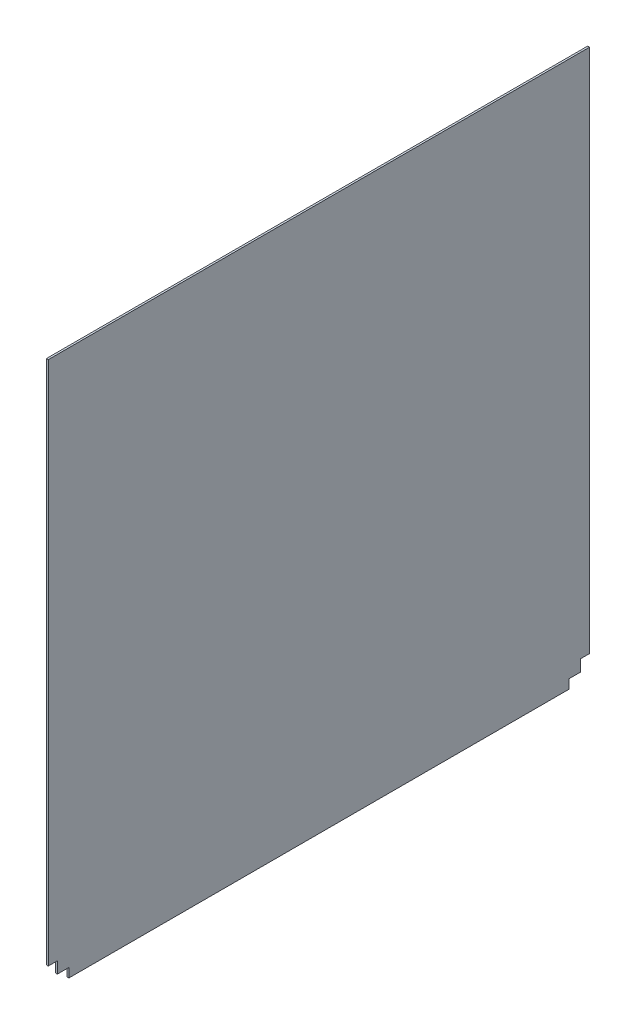
ISO-10303-21;
HEADER;
FILE_DESCRIPTION(('STEP AP214'),'2;1');
FILE_NAME('part.step','',(''),(''),'','','');
FILE_SCHEMA(('AUTOMOTIVE_DESIGN { 1 0 10303 214 1 1 1 1 }'));
ENDSEC;
DATA;
#1=APPLICATION_CONTEXT('core data for automotive mechanical design processes');
#2=APPLICATION_PROTOCOL_DEFINITION('international standard','automotive_design',2000,#1);
#3=PRODUCT_CONTEXT('',#1,'mechanical');
#4=PRODUCT('Part','Part','',(#3));
#5=PRODUCT_RELATED_PRODUCT_CATEGORY('part','',(#4));
#6=PRODUCT_DEFINITION_FORMATION('','',#4);
#7=PRODUCT_DEFINITION_CONTEXT('part definition',#1,'design');
#8=PRODUCT_DEFINITION('design','',#6,#7);
#9=PRODUCT_DEFINITION_SHAPE('','',#8);
#10=(LENGTH_UNIT() NAMED_UNIT(*) SI_UNIT(.MILLI.,.METRE.));
#11=(NAMED_UNIT(*) PLANE_ANGLE_UNIT() SI_UNIT($,.RADIAN.));
#12=(NAMED_UNIT(*) SI_UNIT($,.STERADIAN.) SOLID_ANGLE_UNIT());
#13=UNCERTAINTY_MEASURE_WITH_UNIT(LENGTH_MEASURE(1.E-05),#10,'distance_accuracy_value','');
#14=(GEOMETRIC_REPRESENTATION_CONTEXT(3) GLOBAL_UNCERTAINTY_ASSIGNED_CONTEXT((#13)) GLOBAL_UNIT_ASSIGNED_CONTEXT((#10,
#11,#12)) REPRESENTATION_CONTEXT('',''));
#15=CARTESIAN_POINT('',(0.,0.,0.));
#16=DIRECTION('',(0.,0.,1.));
#17=DIRECTION('',(1.,0.,0.));
#18=AXIS2_PLACEMENT_3D('',#15,#16,#17);
#19=CARTESIAN_POINT('',(3.175,15.24,0.));
#20=DIRECTION('',(0.,1.,0.));
#21=DIRECTION('',(0.,0.,1.));
#22=AXIS2_PLACEMENT_3D('',#19,#20,#21);
#23=PLANE('',#22);
#24=DIRECTION('',(0.,0.,-1.));
#25=VECTOR('',#24,1.);
#26=CARTESIAN_POINT('',(0.,15.24,0.));
#27=LINE('',#26,#25);
#28=CARTESIAN_POINT('',(0.,15.24,-15.24));
#29=VERTEX_POINT('',#28);
#30=CARTESIAN_POINT('',(0.,15.24,-34.544));
#31=VERTEX_POINT('',#30);
#32=EDGE_CURVE('E174',#29,#31,#27,.T.);
#33=ORIENTED_EDGE('',*,*,#32,.T.);
#34=DIRECTION('',(-1.,0.,0.));
#35=VECTOR('',#34,1.);
#36=CARTESIAN_POINT('',(3.175,15.24,-34.544));
#37=LINE('',#36,#35);
#38=CARTESIAN_POINT('',(3.175,15.24,-34.544));
#39=VERTEX_POINT('',#38);
#40=EDGE_CURVE('E11',#39,#31,#37,.T.);
#41=ORIENTED_EDGE('',*,*,#40,.F.);
#42=DIRECTION('',(0.,0.,-1.));
#43=VECTOR('',#42,1.);
#44=CARTESIAN_POINT('',(3.175,15.24,0.));
#45=LINE('',#44,#43);
#46=CARTESIAN_POINT('',(3.175,15.24,-15.24));
#47=VERTEX_POINT('',#46);
#48=EDGE_CURVE('E215',#47,#39,#45,.T.);
#49=ORIENTED_EDGE('',*,*,#48,.F.);
#50=DIRECTION('',(-1.,0.,0.));
#51=VECTOR('',#50,1.);
#52=CARTESIAN_POINT('',(3.175,15.24,-15.24));
#53=LINE('',#52,#51);
#54=EDGE_CURVE('E173',#47,#29,#53,.T.);
#55=ORIENTED_EDGE('',*,*,#54,.T.);
#56=EDGE_LOOP('',(#33,#41,#49,#55));
#57=FACE_BOUND('',#56,.T.);
#58=ADVANCED_FACE('F47',(#57),#23,.F.);
#59=CARTESIAN_POINT('',(3.175,0.,-34.544));
#60=DIRECTION('',(0.,0.,-1.));
#61=DIRECTION('',(0.,1.,0.));
#62=AXIS2_PLACEMENT_3D('',#59,#60,#61);
#63=PLANE('',#62);
#64=DIRECTION('',(0.,-1.,0.));
#65=VECTOR('',#64,1.);
#66=CARTESIAN_POINT('',(0.,0.,-34.544));
#67=LINE('',#66,#65);
#68=CARTESIAN_POINT('',(0.,0.,-34.544));
#69=VERTEX_POINT('',#68);
#70=EDGE_CURVE('E178',#31,#69,#67,.T.);
#71=ORIENTED_EDGE('',*,*,#70,.T.);
#72=DIRECTION('',(-1.,0.,0.));
#73=VECTOR('',#72,1.);
#74=CARTESIAN_POINT('',(3.175,0.,-34.544));
#75=LINE('',#74,#73);
#76=CARTESIAN_POINT('',(3.175,0.,-34.544));
#77=VERTEX_POINT('',#76);
#78=EDGE_CURVE('E56',#77,#69,#75,.T.);
#79=ORIENTED_EDGE('',*,*,#78,.F.);
#80=DIRECTION('',(0.,-1.,0.));
#81=VECTOR('',#80,1.);
#82=CARTESIAN_POINT('',(3.175,0.,-34.544));
#83=LINE('',#82,#81);
#84=EDGE_CURVE('E118',#39,#77,#83,.T.);
#85=ORIENTED_EDGE('',*,*,#84,.F.);
#86=ORIENTED_EDGE('',*,*,#40,.T.);
#87=EDGE_LOOP('',(#71,#79,#85,#86));
#88=FACE_BOUND('',#87,.T.);
#89=ADVANCED_FACE('F300',(#88),#63,.F.);
#90=CARTESIAN_POINT('',(3.175,0.,0.));
#91=DIRECTION('',(0.,1.,0.));
#92=DIRECTION('',(0.,0.,1.));
#93=AXIS2_PLACEMENT_3D('',#90,#91,#92);
#94=PLANE('',#93);
#95=DIRECTION('',(0.,0.,-1.));
#96=VECTOR('',#95,1.);
#97=CARTESIAN_POINT('',(0.,0.,0.));
#98=LINE('',#97,#96);
#99=CARTESIAN_POINT('',(0.,0.,-872.45698));
#100=VERTEX_POINT('',#99);
#101=EDGE_CURVE('E181',#69,#100,#98,.T.);
#102=ORIENTED_EDGE('',*,*,#101,.T.);
#103=DIRECTION('',(-1.,0.,0.));
#104=VECTOR('',#103,1.);
#105=CARTESIAN_POINT('',(3.175,0.,-872.45698));
#106=LINE('',#105,#104);
#107=CARTESIAN_POINT('',(3.175,0.,-872.45698));
#108=VERTEX_POINT('',#107);
#109=EDGE_CURVE('E237',#108,#100,#106,.T.);
#110=ORIENTED_EDGE('',*,*,#109,.F.);
#111=DIRECTION('',(0.,0.,-1.));
#112=VECTOR('',#111,1.);
#113=CARTESIAN_POINT('',(3.175,0.,0.));
#114=LINE('',#113,#112);
#115=EDGE_CURVE('E246',#77,#108,#114,.T.);
#116=ORIENTED_EDGE('',*,*,#115,.F.);
#117=ORIENTED_EDGE('',*,*,#78,.T.);
#118=EDGE_LOOP('',(#102,#110,#116,#117));
#119=FACE_BOUND('',#118,.T.);
#120=ADVANCED_FACE('F244',(#119),#94,.F.);
#121=CARTESIAN_POINT('',(3.175,0.,-872.45698));
#122=DIRECTION('',(0.,0.,-1.));
#123=DIRECTION('',(-1.,0.,0.));
#124=AXIS2_PLACEMENT_3D('',#121,#122,#123);
#125=PLANE('',#124);
#126=DIRECTION('',(0.,-1.,0.));
#127=VECTOR('',#126,1.);
#128=CARTESIAN_POINT('',(0.,0.,-872.45698));
#129=LINE('',#128,#127);
#130=CARTESIAN_POINT('',(0.,15.24,-872.45698));
#131=VERTEX_POINT('',#130);
#132=EDGE_CURVE('E185',#131,#100,#129,.T.);
#133=ORIENTED_EDGE('',*,*,#132,.F.);
#134=DIRECTION('',(-1.,0.,0.));
#135=VECTOR('',#134,1.);
#136=CARTESIAN_POINT('',(3.175,15.24,-872.45698));
#137=LINE('',#136,#135);
#138=CARTESIAN_POINT('',(3.175,15.24,-872.45698));
#139=VERTEX_POINT('',#138);
#140=EDGE_CURVE('E234',#139,#131,#137,.T.);
#141=ORIENTED_EDGE('',*,*,#140,.F.);
#142=DIRECTION('',(0.,-1.,0.));
#143=VECTOR('',#142,1.);
#144=CARTESIAN_POINT('',(3.175,0.,-872.45698));
#145=LINE('',#144,#143);
#146=EDGE_CURVE('E256',#139,#108,#145,.T.);
#147=ORIENTED_EDGE('',*,*,#146,.T.);
#148=ORIENTED_EDGE('',*,*,#109,.T.);
#149=EDGE_LOOP('',(#133,#141,#147,#148));
#150=FACE_BOUND('',#149,.T.);
#151=ADVANCED_FACE('F253',(#150),#125,.T.);
#152=CARTESIAN_POINT('',(3.175,15.24,0.));
#153=DIRECTION('',(0.,-1.,0.));
#154=DIRECTION('',(0.,0.,-1.));
#155=AXIS2_PLACEMENT_3D('',#152,#153,#154);
#156=PLANE('',#155);
#157=DIRECTION('',(0.,0.,1.));
#158=VECTOR('',#157,1.);
#159=CARTESIAN_POINT('',(0.,15.24,0.));
#160=LINE('',#159,#158);
#161=CARTESIAN_POINT('',(0.,15.24,-891.76098));
#162=VERTEX_POINT('',#161);
#163=EDGE_CURVE('E189',#162,#131,#160,.T.);
#164=ORIENTED_EDGE('',*,*,#163,.F.);
#165=DIRECTION('',(-1.,0.,0.));
#166=VECTOR('',#165,1.);
#167=CARTESIAN_POINT('',(3.175,15.24,-891.76098));
#168=LINE('',#167,#166);
#169=CARTESIAN_POINT('',(3.175,15.24,-891.76098));
#170=VERTEX_POINT('',#169);
#171=EDGE_CURVE('E231',#170,#162,#168,.T.);
#172=ORIENTED_EDGE('',*,*,#171,.F.);
#173=DIRECTION('',(0.,0.,1.));
#174=VECTOR('',#173,1.);
#175=CARTESIAN_POINT('',(3.175,15.24,0.));
#176=LINE('',#175,#174);
#177=EDGE_CURVE('E260',#170,#139,#176,.T.);
#178=ORIENTED_EDGE('',*,*,#177,.T.);
#179=ORIENTED_EDGE('',*,*,#140,.T.);
#180=EDGE_LOOP('',(#164,#172,#178,#179));
#181=FACE_BOUND('',#180,.T.);
#182=ADVANCED_FACE('F311',(#181),#156,.T.);
#183=CARTESIAN_POINT('',(3.175,0.,-891.76098));
#184=DIRECTION('',(0.,0.,-1.));
#185=DIRECTION('',(-1.,0.,0.));
#186=AXIS2_PLACEMENT_3D('',#183,#184,#185);
#187=PLANE('',#186);
#188=DIRECTION('',(0.,-1.,0.));
#189=VECTOR('',#188,1.);
#190=CARTESIAN_POINT('',(0.,0.,-891.76098));
#191=LINE('',#190,#189);
#192=CARTESIAN_POINT('',(0.,34.544,-891.76098));
#193=VERTEX_POINT('',#192);
#194=EDGE_CURVE('E193',#193,#162,#191,.T.);
#195=ORIENTED_EDGE('',*,*,#194,.F.);
#196=DIRECTION('',(-1.,0.,0.));
#197=VECTOR('',#196,1.);
#198=CARTESIAN_POINT('',(3.175,34.544,-891.76098));
#199=LINE('',#198,#197);
#200=CARTESIAN_POINT('',(3.175,34.544,-891.76098));
#201=VERTEX_POINT('',#200);
#202=EDGE_CURVE('E228',#201,#193,#199,.T.);
#203=ORIENTED_EDGE('',*,*,#202,.F.);
#204=DIRECTION('',(0.,-1.,0.));
#205=VECTOR('',#204,1.);
#206=CARTESIAN_POINT('',(3.175,0.,-891.76098));
#207=LINE('',#206,#205);
#208=EDGE_CURVE('E264',#201,#170,#207,.T.);
#209=ORIENTED_EDGE('',*,*,#208,.T.);
#210=ORIENTED_EDGE('',*,*,#171,.T.);
#211=EDGE_LOOP('',(#195,#203,#209,#210));
#212=FACE_BOUND('',#211,.T.);
#213=ADVANCED_FACE('F314',(#212),#187,.T.);
#214=CARTESIAN_POINT('',(3.175,34.5439999999996,0.));
#215=DIRECTION('',(0.,-1.,0.));
#216=DIRECTION('',(0.,0.,-1.));
#217=AXIS2_PLACEMENT_3D('',#214,#215,#216);
#218=PLANE('',#217);
#219=DIRECTION('',(0.,0.,1.));
#220=VECTOR('',#219,1.);
#221=CARTESIAN_POINT('',(0.,34.5439999999996,0.));
#222=LINE('',#221,#220);
#223=CARTESIAN_POINT('',(0.,34.544,-907.00098));
#224=VERTEX_POINT('',#223);
#225=EDGE_CURVE('E197',#224,#193,#222,.T.);
#226=ORIENTED_EDGE('',*,*,#225,.F.);
#227=DIRECTION('',(-1.,0.,0.));
#228=VECTOR('',#227,1.);
#229=CARTESIAN_POINT('',(3.175,34.544,-907.00098));
#230=LINE('',#229,#228);
#231=CARTESIAN_POINT('',(3.175,34.544,-907.00098));
#232=VERTEX_POINT('',#231);
#233=EDGE_CURVE('E225',#232,#224,#230,.T.);
#234=ORIENTED_EDGE('',*,*,#233,.F.);
#235=DIRECTION('',(0.,0.,1.));
#236=VECTOR('',#235,1.);
#237=CARTESIAN_POINT('',(3.175,34.5439999999996,0.));
#238=LINE('',#237,#236);
#239=EDGE_CURVE('E272',#232,#201,#238,.T.);
#240=ORIENTED_EDGE('',*,*,#239,.T.);
#241=ORIENTED_EDGE('',*,*,#202,.T.);
#242=EDGE_LOOP('',(#226,#234,#240,#241));
#243=FACE_BOUND('',#242,.T.);
#244=ADVANCED_FACE('F318',(#243),#218,.T.);
#245=CARTESIAN_POINT('',(3.175,0.,-907.00098));
#246=DIRECTION('',(0.,0.,1.));
#247=DIRECTION('',(1.,0.,0.));
#248=AXIS2_PLACEMENT_3D('',#245,#246,#247);
#249=PLANE('',#248);
#250=DIRECTION('',(0.,1.,0.));
#251=VECTOR('',#250,1.);
#252=CARTESIAN_POINT('',(0.,0.,-907.00098));
#253=LINE('',#252,#251);
#254=CARTESIAN_POINT('',(0.,914.4,-907.00098));
#255=VERTEX_POINT('',#254);
#256=EDGE_CURVE('E201',#224,#255,#253,.T.);
#257=ORIENTED_EDGE('',*,*,#256,.T.);
#258=DIRECTION('',(-1.,0.,0.));
#259=VECTOR('',#258,1.);
#260=CARTESIAN_POINT('',(3.175,914.4,-907.00098));
#261=LINE('',#260,#259);
#262=CARTESIAN_POINT('',(3.175,914.4,-907.00098));
#263=VERTEX_POINT('',#262);
#264=EDGE_CURVE('E222',#263,#255,#261,.T.);
#265=ORIENTED_EDGE('',*,*,#264,.F.);
#266=DIRECTION('',(0.,1.,0.));
#267=VECTOR('',#266,1.);
#268=CARTESIAN_POINT('',(3.175,0.,-907.00098));
#269=LINE('',#268,#267);
#270=EDGE_CURVE('E167',#232,#263,#269,.T.);
#271=ORIENTED_EDGE('',*,*,#270,.F.);
#272=ORIENTED_EDGE('',*,*,#233,.T.);
#273=EDGE_LOOP('',(#257,#265,#271,#272));
#274=FACE_BOUND('',#273,.T.);
#275=ADVANCED_FACE('F281',(#274),#249,.F.);
#276=CARTESIAN_POINT('',(3.175,914.4,0.));
#277=DIRECTION('',(0.,1.,0.));
#278=DIRECTION('',(0.,0.,1.));
#279=AXIS2_PLACEMENT_3D('',#276,#277,#278);
#280=PLANE('',#279);
#281=DIRECTION('',(0.,0.,-1.));
#282=VECTOR('',#281,1.);
#283=CARTESIAN_POINT('',(0.,914.4,0.));
#284=LINE('',#283,#282);
#285=CARTESIAN_POINT('',(0.,914.4,0.));
#286=VERTEX_POINT('',#285);
#287=EDGE_CURVE('E205',#286,#255,#284,.T.);
#288=ORIENTED_EDGE('',*,*,#287,.F.);
#289=DIRECTION('',(-1.,0.,0.));
#290=VECTOR('',#289,1.);
#291=CARTESIAN_POINT('',(3.175,914.4,0.));
#292=LINE('',#291,#290);
#293=CARTESIAN_POINT('',(3.175,914.4,0.));
#294=VERTEX_POINT('',#293);
#295=EDGE_CURVE('E153',#294,#286,#292,.T.);
#296=ORIENTED_EDGE('',*,*,#295,.F.);
#297=DIRECTION('',(0.,0.,-1.));
#298=VECTOR('',#297,1.);
#299=CARTESIAN_POINT('',(3.175,914.4,0.));
#300=LINE('',#299,#298);
#301=EDGE_CURVE('E163',#294,#263,#300,.T.);
#302=ORIENTED_EDGE('',*,*,#301,.T.);
#303=ORIENTED_EDGE('',*,*,#264,.T.);
#304=EDGE_LOOP('',(#288,#296,#302,#303));
#305=FACE_BOUND('',#304,.T.);
#306=ADVANCED_FACE('F285',(#305),#280,.T.);
#307=CARTESIAN_POINT('',(3.175,0.,0.));
#308=DIRECTION('',(0.,0.,1.));
#309=DIRECTION('',(1.,0.,0.));
#310=AXIS2_PLACEMENT_3D('',#307,#308,#309);
#311=PLANE('',#310);
#312=DIRECTION('',(0.,1.,0.));
#313=VECTOR('',#312,1.);
#314=CARTESIAN_POINT('',(0.,0.,0.));
#315=LINE('',#314,#313);
#316=CARTESIAN_POINT('',(0.,34.544,0.));
#317=VERTEX_POINT('',#316);
#318=EDGE_CURVE('E151',#317,#286,#315,.T.);
#319=ORIENTED_EDGE('',*,*,#318,.F.);
#320=DIRECTION('',(-1.,0.,0.));
#321=VECTOR('',#320,1.);
#322=CARTESIAN_POINT('',(3.175,34.544,0.));
#323=LINE('',#322,#321);
#324=CARTESIAN_POINT('',(3.175,34.544,0.));
#325=VERTEX_POINT('',#324);
#326=EDGE_CURVE('E145',#325,#317,#323,.T.);
#327=ORIENTED_EDGE('',*,*,#326,.F.);
#328=DIRECTION('',(0.,1.,0.));
#329=VECTOR('',#328,1.);
#330=CARTESIAN_POINT('',(3.175,0.,0.));
#331=LINE('',#330,#329);
#332=EDGE_CURVE('E149',#325,#294,#331,.T.);
#333=ORIENTED_EDGE('',*,*,#332,.T.);
#334=ORIENTED_EDGE('',*,*,#295,.T.);
#335=EDGE_LOOP('',(#319,#327,#333,#334));
#336=FACE_BOUND('',#335,.T.);
#337=ADVANCED_FACE('F147',(#336),#311,.T.);
#338=CARTESIAN_POINT('',(3.175,34.544,0.));
#339=DIRECTION('',(0.,1.,0.));
#340=DIRECTION('',(0.,0.,1.));
#341=AXIS2_PLACEMENT_3D('',#338,#339,#340);
#342=PLANE('',#341);
#343=DIRECTION('',(0.,0.,-1.));
#344=VECTOR('',#343,1.);
#345=CARTESIAN_POINT('',(0.,34.544,0.));
#346=LINE('',#345,#344);
#347=CARTESIAN_POINT('',(0.,34.544,-15.24));
#348=VERTEX_POINT('',#347);
#349=EDGE_CURVE('E104',#317,#348,#346,.T.);
#350=ORIENTED_EDGE('',*,*,#349,.T.);
#351=DIRECTION('',(-1.,0.,0.));
#352=VECTOR('',#351,1.);
#353=CARTESIAN_POINT('',(3.175,34.544,-15.24));
#354=LINE('',#353,#352);
#355=CARTESIAN_POINT('',(3.175,34.544,-15.24));
#356=VERTEX_POINT('',#355);
#357=EDGE_CURVE('E154',#356,#348,#354,.T.);
#358=ORIENTED_EDGE('',*,*,#357,.F.);
#359=DIRECTION('',(0.,0.,-1.));
#360=VECTOR('',#359,1.);
#361=CARTESIAN_POINT('',(3.175,34.544,0.));
#362=LINE('',#361,#360);
#363=EDGE_CURVE('E156',#325,#356,#362,.T.);
#364=ORIENTED_EDGE('',*,*,#363,.F.);
#365=ORIENTED_EDGE('',*,*,#326,.T.);
#366=EDGE_LOOP('',(#350,#358,#364,#365));
#367=FACE_BOUND('',#366,.T.);
#368=ADVANCED_FACE('F157',(#367),#342,.F.);
#369=CARTESIAN_POINT('',(3.175,0.,-15.24));
#370=DIRECTION('',(0.,0.,-1.));
#371=DIRECTION('',(0.,1.,0.));
#372=AXIS2_PLACEMENT_3D('',#369,#370,#371);
#373=PLANE('',#372);
#374=DIRECTION('',(0.,-1.,0.));
#375=VECTOR('',#374,1.);
#376=CARTESIAN_POINT('',(0.,0.,-15.24));
#377=LINE('',#376,#375);
#378=EDGE_CURVE('E110',#348,#29,#377,.T.);
#379=ORIENTED_EDGE('',*,*,#378,.T.);
#380=ORIENTED_EDGE('',*,*,#54,.F.);
#381=DIRECTION('',(0.,-1.,0.));
#382=VECTOR('',#381,1.);
#383=CARTESIAN_POINT('',(3.175,0.,-15.24));
#384=LINE('',#383,#382);
#385=EDGE_CURVE('E64',#356,#47,#384,.T.);
#386=ORIENTED_EDGE('',*,*,#385,.F.);
#387=ORIENTED_EDGE('',*,*,#357,.T.);
#388=EDGE_LOOP('',(#379,#380,#386,#387));
#389=FACE_BOUND('',#388,.T.);
#390=ADVANCED_FACE('F289',(#389),#373,.F.);
#391=CARTESIAN_POINT('',(3.175,0.,0.));
#392=DIRECTION('',(1.,0.,0.));
#393=DIRECTION('',(0.,0.,-1.));
#394=AXIS2_PLACEMENT_3D('',#391,#392,#393);
#395=PLANE('',#394);
#396=ORIENTED_EDGE('',*,*,#48,.T.);
#397=ORIENTED_EDGE('',*,*,#84,.T.);
#398=ORIENTED_EDGE('',*,*,#115,.T.);
#399=ORIENTED_EDGE('',*,*,#146,.F.);
#400=ORIENTED_EDGE('',*,*,#177,.F.);
#401=ORIENTED_EDGE('',*,*,#208,.F.);
#402=ORIENTED_EDGE('',*,*,#239,.F.);
#403=ORIENTED_EDGE('',*,*,#270,.T.);
#404=ORIENTED_EDGE('',*,*,#301,.F.);
#405=ORIENTED_EDGE('',*,*,#332,.F.);
#406=ORIENTED_EDGE('',*,*,#363,.T.);
#407=ORIENTED_EDGE('',*,*,#385,.T.);
#408=EDGE_LOOP('',(#396,#397,#398,#399,#400,#401,#402,#403,#404,#405,#406,#407));
#409=FACE_BOUND('',#408,.T.);
#410=ADVANCED_FACE('F161',(#409),#395,.T.);
#411=CARTESIAN_POINT('',(0.,0.,0.));
#412=DIRECTION('',(1.,0.,0.));
#413=DIRECTION('',(0.,0.,-1.));
#414=AXIS2_PLACEMENT_3D('',#411,#412,#413);
#415=PLANE('',#414);
#416=ORIENTED_EDGE('',*,*,#32,.F.);
#417=ORIENTED_EDGE('',*,*,#378,.F.);
#418=ORIENTED_EDGE('',*,*,#349,.F.);
#419=ORIENTED_EDGE('',*,*,#318,.T.);
#420=ORIENTED_EDGE('',*,*,#287,.T.);
#421=ORIENTED_EDGE('',*,*,#256,.F.);
#422=ORIENTED_EDGE('',*,*,#225,.T.);
#423=ORIENTED_EDGE('',*,*,#194,.T.);
#424=ORIENTED_EDGE('',*,*,#163,.T.);
#425=ORIENTED_EDGE('',*,*,#132,.T.);
#426=ORIENTED_EDGE('',*,*,#101,.F.);
#427=ORIENTED_EDGE('',*,*,#70,.F.);
#428=EDGE_LOOP('',(#416,#417,#418,#419,#420,#421,#422,#423,#424,#425,#426,#427));
#429=FACE_BOUND('',#428,.T.);
#430=ADVANCED_FACE('F249',(#429),#415,.F.);
#431=CLOSED_SHELL('',(#58,#89,#120,#151,#182,#213,#244,#275,#306,#337,#368,#390,#410,#430));
#432=MANIFOLD_SOLID_BREP('B2',#431);
#433=ADVANCED_BREP_SHAPE_REPRESENTATION('',(#18,#432),#14);
#434=SHAPE_DEFINITION_REPRESENTATION(#9,#433);
ENDSEC;
END-ISO-10303-21;
